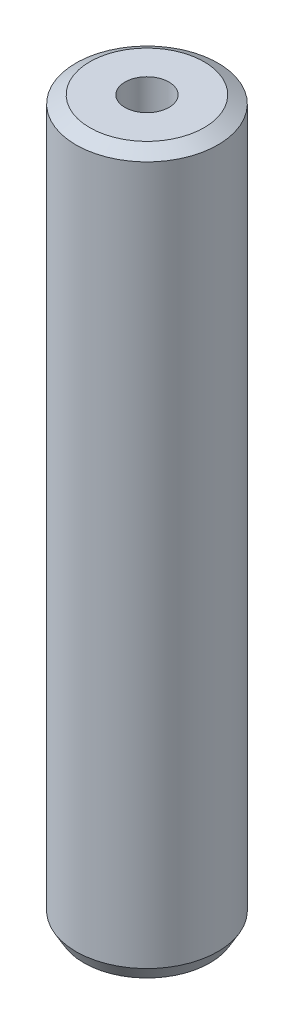
ISO-10303-21;
HEADER;
FILE_DESCRIPTION(('STEP AP214'),'2;1');
FILE_NAME('part.step','',(''),(''),'','','');
FILE_SCHEMA(('AUTOMOTIVE_DESIGN { 1 0 10303 214 1 1 1 1 }'));
ENDSEC;
DATA;
#1=APPLICATION_CONTEXT('core data for automotive mechanical design processes');
#2=APPLICATION_PROTOCOL_DEFINITION('international standard','automotive_design',2000,#1);
#3=PRODUCT_CONTEXT('',#1,'mechanical');
#4=PRODUCT('Part','Part','',(#3));
#5=PRODUCT_RELATED_PRODUCT_CATEGORY('part','',(#4));
#6=PRODUCT_DEFINITION_FORMATION('','',#4);
#7=PRODUCT_DEFINITION_CONTEXT('part definition',#1,'design');
#8=PRODUCT_DEFINITION('design','',#6,#7);
#9=PRODUCT_DEFINITION_SHAPE('','',#8);
#10=(LENGTH_UNIT() NAMED_UNIT(*) SI_UNIT(.MILLI.,.METRE.));
#11=(NAMED_UNIT(*) PLANE_ANGLE_UNIT() SI_UNIT($,.RADIAN.));
#12=(NAMED_UNIT(*) SI_UNIT($,.STERADIAN.) SOLID_ANGLE_UNIT());
#13=UNCERTAINTY_MEASURE_WITH_UNIT(LENGTH_MEASURE(1.E-05),#10,'distance_accuracy_value','');
#14=(GEOMETRIC_REPRESENTATION_CONTEXT(3) GLOBAL_UNCERTAINTY_ASSIGNED_CONTEXT((#13)) GLOBAL_UNIT_ASSIGNED_CONTEXT((#10,
#11,#12)) REPRESENTATION_CONTEXT('',''));
#15=CARTESIAN_POINT('',(0.,0.,0.));
#16=DIRECTION('',(0.,0.,1.));
#17=DIRECTION('',(1.,0.,0.));
#18=AXIS2_PLACEMENT_3D('',#15,#16,#17);
#19=CARTESIAN_POINT('',(0.,532.833848757859,0.));
#20=DIRECTION('',(0.,-1.,0.));
#21=DIRECTION('',(0.,0.,-1.));
#22=AXIS2_PLACEMENT_3D('',#19,#20,#21);
#23=CYLINDRICAL_SURFACE('',#22,52.5);
#24=CARTESIAN_POINT('',(0.,526.924049774197,0.));
#25=DIRECTION('',(0.,1.,0.));
#26=DIRECTION('',(0.,0.,1.));
#27=AXIS2_PLACEMENT_3D('',#24,#25,#26);
#28=CIRCLE('',#27,52.5);
#29=CARTESIAN_POINT('',(0.,526.924049774197,52.5));
#30=VERTEX_POINT('',#29);
#31=EDGE_CURVE('E50',#30,#30,#28,.F.);
#32=ORIENTED_EDGE('',*,*,#31,.T.);
#33=EDGE_LOOP('',(#32));
#34=FACE_BOUND('',#33,.T.);
#35=CARTESIAN_POINT('',(0.,10.2360721022203,0.));
#36=DIRECTION('',(0.,1.,0.));
#37=DIRECTION('',(0.,0.,1.));
#38=AXIS2_PLACEMENT_3D('',#35,#36,#37);
#39=CIRCLE('',#38,52.5);
#40=CARTESIAN_POINT('',(0.,10.2360721022203,52.5));
#41=VERTEX_POINT('',#40);
#42=EDGE_CURVE('E51',#41,#41,#39,.T.);
#43=ORIENTED_EDGE('',*,*,#42,.T.);
#44=EDGE_LOOP('',(#43));
#45=FACE_BOUND('',#44,.T.);
#46=ADVANCED_FACE('F39',(#34,#45),#23,.T.);
#47=CARTESIAN_POINT('',(0.,532.833848757859,0.));
#48=DIRECTION('',(0.,1.,0.));
#49=DIRECTION('',(0.,0.,1.));
#50=AXIS2_PLACEMENT_3D('',#47,#48,#49);
#51=PLANE('',#50);
#52=CARTESIAN_POINT('',(0.,532.833848757859,0.));
#53=DIRECTION('',(0.,1.,0.));
#54=DIRECTION('',(0.,0.,1.));
#55=AXIS2_PLACEMENT_3D('',#52,#53,#54);
#56=CIRCLE('',#55,42.2639278977796);
#57=CARTESIAN_POINT('',(0.,532.833848757859,42.2639278977796));
#58=VERTEX_POINT('',#57);
#59=EDGE_CURVE('E54',#58,#58,#56,.T.);
#60=ORIENTED_EDGE('',*,*,#59,.T.);
#61=EDGE_LOOP('',(#60));
#62=FACE_BOUND('',#61,.T.);
#63=CARTESIAN_POINT('',(0.,532.833848757859,0.));
#64=DIRECTION('',(0.,1.,0.));
#65=DIRECTION('',(0.,0.,1.));
#66=AXIS2_PLACEMENT_3D('',#63,#64,#65);
#67=CIRCLE('',#66,16.2939867500379);
#68=CARTESIAN_POINT('',(0.,532.833848757859,16.2939867500379));
#69=VERTEX_POINT('',#68);
#70=EDGE_CURVE('E58',#69,#69,#67,.T.);
#71=ORIENTED_EDGE('',*,*,#70,.F.);
#72=EDGE_LOOP('',(#71));
#73=FACE_BOUND('',#72,.T.);
#74=ADVANCED_FACE('F69',(#62,#73),#51,.T.);
#75=CARTESIAN_POINT('',(0.,0.,0.));
#76=DIRECTION('',(0.,1.,0.));
#77=DIRECTION('',(0.,0.,1.));
#78=AXIS2_PLACEMENT_3D('',#75,#76,#77);
#79=PLANE('',#78);
#80=CARTESIAN_POINT('',(0.,0.,0.));
#81=DIRECTION('',(0.,1.,0.));
#82=DIRECTION('',(0.,0.,1.));
#83=AXIS2_PLACEMENT_3D('',#80,#81,#82);
#84=CIRCLE('',#83,46.5902010163386);
#85=CARTESIAN_POINT('',(0.,0.,46.5902010163386));
#86=VERTEX_POINT('',#85);
#87=EDGE_CURVE('E10',#86,#86,#84,.F.);
#88=ORIENTED_EDGE('',*,*,#87,.T.);
#89=EDGE_LOOP('',(#88));
#90=FACE_BOUND('',#89,.T.);
#91=CARTESIAN_POINT('',(0.,0.,0.));
#92=DIRECTION('',(0.,1.,0.));
#93=DIRECTION('',(0.,0.,1.));
#94=AXIS2_PLACEMENT_3D('',#91,#92,#93);
#95=CIRCLE('',#94,16.2939867500379);
#96=CARTESIAN_POINT('',(0.,0.,16.2939867500379));
#97=VERTEX_POINT('',#96);
#98=EDGE_CURVE('E63',#97,#97,#95,.T.);
#99=ORIENTED_EDGE('',*,*,#98,.T.);
#100=EDGE_LOOP('',(#99));
#101=FACE_BOUND('',#100,.T.);
#102=ADVANCED_FACE('F75',(#90,#101),#79,.F.);
#103=CARTESIAN_POINT('',(0.,532.833848757859,0.));
#104=DIRECTION('',(0.,-1.,0.));
#105=DIRECTION('',(0.,0.,-1.));
#106=AXIS2_PLACEMENT_3D('',#103,#104,#105);
#107=CYLINDRICAL_SURFACE('',#106,16.2939867500379);
#108=ORIENTED_EDGE('',*,*,#70,.T.);
#109=EDGE_LOOP('',(#108));
#110=FACE_BOUND('',#109,.T.);
#111=ORIENTED_EDGE('',*,*,#98,.F.);
#112=EDGE_LOOP('',(#111));
#113=FACE_BOUND('',#112,.T.);
#114=ADVANCED_FACE('F70',(#110,#113),#107,.F.);
#115=CARTESIAN_POINT('',(0.,532.833848757859,0.));
#116=DIRECTION('',(0.,-1.,0.));
#117=DIRECTION('',(0.,0.,-1.));
#118=AXIS2_PLACEMENT_3D('',#115,#116,#117);
#119=CONICAL_SURFACE('',#118,42.2639278977796,1.04719755119659);
#120=ORIENTED_EDGE('',*,*,#31,.F.);
#121=EDGE_LOOP('',(#120));
#122=FACE_BOUND('',#121,.T.);
#123=ORIENTED_EDGE('',*,*,#59,.F.);
#124=EDGE_LOOP('',(#123));
#125=FACE_BOUND('',#124,.T.);
#126=ADVANCED_FACE('F81',(#122,#125),#119,.T.);
#127=CARTESIAN_POINT('',(0.,10.2360721022203,0.));
#128=DIRECTION('',(0.,1.,0.));
#129=DIRECTION('',(0.,0.,1.));
#130=AXIS2_PLACEMENT_3D('',#127,#128,#129);
#131=CONICAL_SURFACE('',#130,52.5,0.523598775598302);
#132=ORIENTED_EDGE('',*,*,#87,.F.);
#133=EDGE_LOOP('',(#132));
#134=FACE_BOUND('',#133,.T.);
#135=ORIENTED_EDGE('',*,*,#42,.F.);
#136=EDGE_LOOP('',(#135));
#137=FACE_BOUND('',#136,.T.);
#138=ADVANCED_FACE('F45',(#134,#137),#131,.T.);
#139=CLOSED_SHELL('',(#46,#74,#102,#114,#126,#138));
#140=MANIFOLD_SOLID_BREP('B2',#139);
#141=ADVANCED_BREP_SHAPE_REPRESENTATION('',(#18,#140),#14);
#142=SHAPE_DEFINITION_REPRESENTATION(#9,#141);
ENDSEC;
END-ISO-10303-21;
